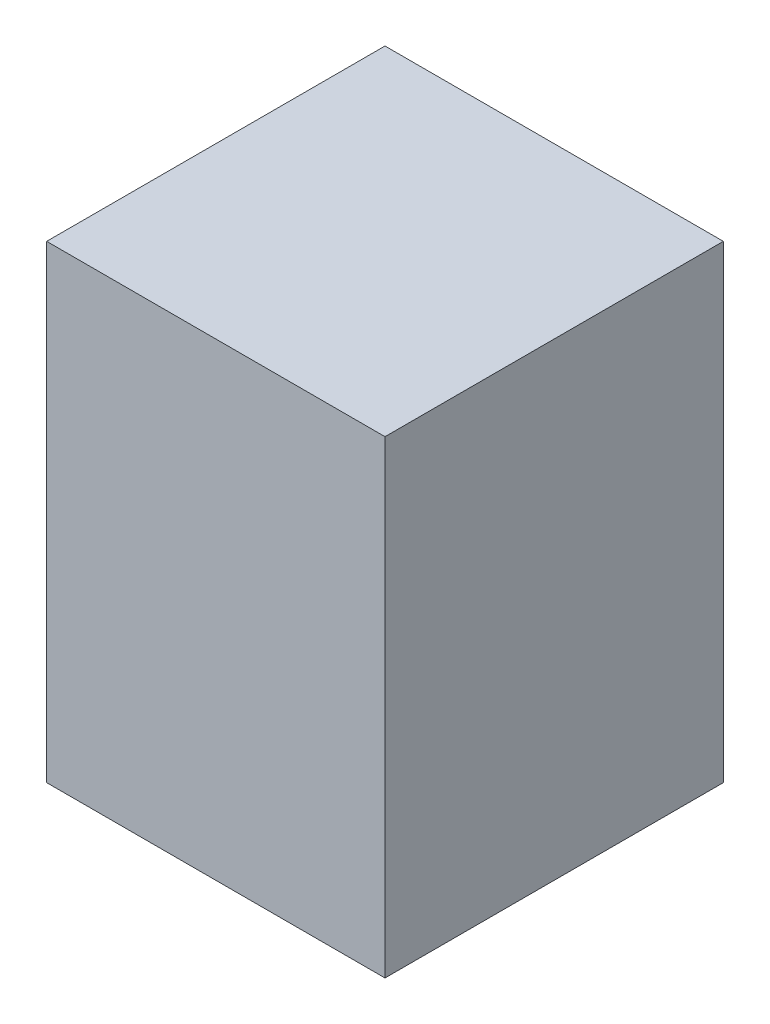
ISO-10303-21;
HEADER;
FILE_DESCRIPTION(('STEP AP214'),'2;1');
FILE_NAME('part.step','',(''),(''),'','','');
FILE_SCHEMA(('AUTOMOTIVE_DESIGN { 1 0 10303 214 1 1 1 1 }'));
ENDSEC;
DATA;
#1=APPLICATION_CONTEXT('core data for automotive mechanical design processes');
#2=APPLICATION_PROTOCOL_DEFINITION('international standard','automotive_design',2000,#1);
#3=PRODUCT_CONTEXT('',#1,'mechanical');
#4=PRODUCT('Part','Part','',(#3));
#5=PRODUCT_RELATED_PRODUCT_CATEGORY('part','',(#4));
#6=PRODUCT_DEFINITION_FORMATION('','',#4);
#7=PRODUCT_DEFINITION_CONTEXT('part definition',#1,'design');
#8=PRODUCT_DEFINITION('design','',#6,#7);
#9=PRODUCT_DEFINITION_SHAPE('','',#8);
#10=(LENGTH_UNIT() NAMED_UNIT(*) SI_UNIT(.MILLI.,.METRE.));
#11=(NAMED_UNIT(*) PLANE_ANGLE_UNIT() SI_UNIT($,.RADIAN.));
#12=(NAMED_UNIT(*) SI_UNIT($,.STERADIAN.) SOLID_ANGLE_UNIT());
#13=UNCERTAINTY_MEASURE_WITH_UNIT(LENGTH_MEASURE(1.E-05),#10,'distance_accuracy_value','');
#14=(GEOMETRIC_REPRESENTATION_CONTEXT(3) GLOBAL_UNCERTAINTY_ASSIGNED_CONTEXT((#13)) GLOBAL_UNIT_ASSIGNED_CONTEXT((#10,
#11,#12)) REPRESENTATION_CONTEXT('',''));
#15=CARTESIAN_POINT('',(0.,0.,0.));
#16=DIRECTION('',(0.,0.,1.));
#17=DIRECTION('',(1.,0.,0.));
#18=AXIS2_PLACEMENT_3D('',#15,#16,#17);
#19=CARTESIAN_POINT('',(-9.75,13.51,0.));
#20=DIRECTION('',(1.,0.,0.));
#21=DIRECTION('',(0.,0.,-1.));
#22=AXIS2_PLACEMENT_3D('',#19,#20,#21);
#23=PLANE('',#22);
#24=DIRECTION('',(0.,0.,1.));
#25=VECTOR('',#24,1.);
#26=CARTESIAN_POINT('',(-9.75,0.,0.));
#27=LINE('',#26,#25);
#28=CARTESIAN_POINT('',(-9.75,0.,0.));
#29=VERTEX_POINT('',#28);
#30=CARTESIAN_POINT('',(-9.75,0.,9.75));
#31=VERTEX_POINT('',#30);
#32=EDGE_CURVE('E102',#29,#31,#27,.T.);
#33=ORIENTED_EDGE('',*,*,#32,.T.);
#34=DIRECTION('',(0.,-1.,0.));
#35=VECTOR('',#34,1.);
#36=CARTESIAN_POINT('',(-9.75,13.51,9.75));
#37=LINE('',#36,#35);
#38=CARTESIAN_POINT('',(-9.75,13.51,9.75));
#39=VERTEX_POINT('',#38);
#40=EDGE_CURVE('E11',#39,#31,#37,.T.);
#41=ORIENTED_EDGE('',*,*,#40,.F.);
#42=DIRECTION('',(0.,0.,1.));
#43=VECTOR('',#42,1.);
#44=CARTESIAN_POINT('',(-9.75,13.51,0.));
#45=LINE('',#44,#43);
#46=CARTESIAN_POINT('',(-9.75,13.51,0.));
#47=VERTEX_POINT('',#46);
#48=EDGE_CURVE('E90',#47,#39,#45,.T.);
#49=ORIENTED_EDGE('',*,*,#48,.F.);
#50=DIRECTION('',(0.,-1.,0.));
#51=VECTOR('',#50,1.);
#52=CARTESIAN_POINT('',(-9.75,13.51,0.));
#53=LINE('',#52,#51);
#54=EDGE_CURVE('E98',#47,#29,#53,.T.);
#55=ORIENTED_EDGE('',*,*,#54,.T.);
#56=EDGE_LOOP('',(#33,#41,#49,#55));
#57=FACE_BOUND('',#56,.T.);
#58=ADVANCED_FACE('F39',(#57),#23,.F.);
#59=CARTESIAN_POINT('',(-9.75,13.51,9.75));
#60=DIRECTION('',(0.,0.,-1.));
#61=DIRECTION('',(-1.,0.,0.));
#62=AXIS2_PLACEMENT_3D('',#59,#60,#61);
#63=PLANE('',#62);
#64=DIRECTION('',(1.,0.,0.));
#65=VECTOR('',#64,1.);
#66=CARTESIAN_POINT('',(-9.75,0.,9.75));
#67=LINE('',#66,#65);
#68=CARTESIAN_POINT('',(0.,0.,9.75));
#69=VERTEX_POINT('',#68);
#70=EDGE_CURVE('E94',#31,#69,#67,.T.);
#71=ORIENTED_EDGE('',*,*,#70,.T.);
#72=DIRECTION('',(0.,-1.,0.));
#73=VECTOR('',#72,1.);
#74=CARTESIAN_POINT('',(0.,13.51,9.75));
#75=LINE('',#74,#73);
#76=CARTESIAN_POINT('',(0.,13.51,9.75));
#77=VERTEX_POINT('',#76);
#78=EDGE_CURVE('E47',#77,#69,#75,.T.);
#79=ORIENTED_EDGE('',*,*,#78,.F.);
#80=DIRECTION('',(1.,0.,0.));
#81=VECTOR('',#80,1.);
#82=CARTESIAN_POINT('',(-9.75,13.51,9.75));
#83=LINE('',#82,#81);
#84=EDGE_CURVE('E85',#39,#77,#83,.T.);
#85=ORIENTED_EDGE('',*,*,#84,.F.);
#86=ORIENTED_EDGE('',*,*,#40,.T.);
#87=EDGE_LOOP('',(#71,#79,#85,#86));
#88=FACE_BOUND('',#87,.T.);
#89=ADVANCED_FACE('F93',(#88),#63,.F.);
#90=CARTESIAN_POINT('',(0.,13.51,0.));
#91=DIRECTION('',(-1.,0.,0.));
#92=DIRECTION('',(0.,0.,1.));
#93=AXIS2_PLACEMENT_3D('',#90,#91,#92);
#94=PLANE('',#93);
#95=DIRECTION('',(0.,0.,-1.));
#96=VECTOR('',#95,1.);
#97=CARTESIAN_POINT('',(0.,0.,0.));
#98=LINE('',#97,#96);
#99=CARTESIAN_POINT('',(0.,0.,0.));
#100=VERTEX_POINT('',#99);
#101=EDGE_CURVE('E72',#69,#100,#98,.T.);
#102=ORIENTED_EDGE('',*,*,#101,.T.);
#103=DIRECTION('',(0.,-1.,0.));
#104=VECTOR('',#103,1.);
#105=CARTESIAN_POINT('',(0.,13.51,0.));
#106=LINE('',#105,#104);
#107=CARTESIAN_POINT('',(0.,13.51,0.));
#108=VERTEX_POINT('',#107);
#109=EDGE_CURVE('E95',#108,#100,#106,.T.);
#110=ORIENTED_EDGE('',*,*,#109,.F.);
#111=DIRECTION('',(0.,0.,-1.));
#112=VECTOR('',#111,1.);
#113=CARTESIAN_POINT('',(0.,13.51,0.));
#114=LINE('',#113,#112);
#115=EDGE_CURVE('E88',#77,#108,#114,.T.);
#116=ORIENTED_EDGE('',*,*,#115,.F.);
#117=ORIENTED_EDGE('',*,*,#78,.T.);
#118=EDGE_LOOP('',(#102,#110,#116,#117));
#119=FACE_BOUND('',#118,.T.);
#120=ADVANCED_FACE('F96',(#119),#94,.F.);
#121=CARTESIAN_POINT('',(-9.75,13.51,0.));
#122=DIRECTION('',(0.,0.,1.));
#123=DIRECTION('',(1.,0.,0.));
#124=AXIS2_PLACEMENT_3D('',#121,#122,#123);
#125=PLANE('',#124);
#126=DIRECTION('',(-1.,0.,0.));
#127=VECTOR('',#126,1.);
#128=CARTESIAN_POINT('',(-9.75,0.,0.));
#129=LINE('',#128,#127);
#130=EDGE_CURVE('E78',#100,#29,#129,.T.);
#131=ORIENTED_EDGE('',*,*,#130,.T.);
#132=ORIENTED_EDGE('',*,*,#54,.F.);
#133=DIRECTION('',(-1.,0.,0.));
#134=VECTOR('',#133,1.);
#135=CARTESIAN_POINT('',(-9.75,13.51,0.));
#136=LINE('',#135,#134);
#137=EDGE_CURVE('E55',#108,#47,#136,.T.);
#138=ORIENTED_EDGE('',*,*,#137,.F.);
#139=ORIENTED_EDGE('',*,*,#109,.T.);
#140=EDGE_LOOP('',(#131,#132,#138,#139));
#141=FACE_BOUND('',#140,.T.);
#142=ADVANCED_FACE('F109',(#141),#125,.F.);
#143=CARTESIAN_POINT('',(0.,13.51,0.));
#144=DIRECTION('',(0.,1.,0.));
#145=DIRECTION('',(0.,0.,1.));
#146=AXIS2_PLACEMENT_3D('',#143,#144,#145);
#147=PLANE('',#146);
#148=ORIENTED_EDGE('',*,*,#48,.T.);
#149=ORIENTED_EDGE('',*,*,#84,.T.);
#150=ORIENTED_EDGE('',*,*,#115,.T.);
#151=ORIENTED_EDGE('',*,*,#137,.T.);
#152=EDGE_LOOP('',(#148,#149,#150,#151));
#153=FACE_BOUND('',#152,.T.);
#154=ADVANCED_FACE('F86',(#153),#147,.T.);
#155=CARTESIAN_POINT('',(0.,0.,0.));
#156=DIRECTION('',(0.,1.,0.));
#157=DIRECTION('',(0.,0.,1.));
#158=AXIS2_PLACEMENT_3D('',#155,#156,#157);
#159=PLANE('',#158);
#160=ORIENTED_EDGE('',*,*,#32,.F.);
#161=ORIENTED_EDGE('',*,*,#130,.F.);
#162=ORIENTED_EDGE('',*,*,#101,.F.);
#163=ORIENTED_EDGE('',*,*,#70,.F.);
#164=EDGE_LOOP('',(#160,#161,#162,#163));
#165=FACE_BOUND('',#164,.T.);
#166=ADVANCED_FACE('F112',(#165),#159,.F.);
#167=CLOSED_SHELL('',(#58,#89,#120,#142,#154,#166));
#168=MANIFOLD_SOLID_BREP('B2',#167);
#169=ADVANCED_BREP_SHAPE_REPRESENTATION('',(#18,#168),#14);
#170=SHAPE_DEFINITION_REPRESENTATION(#9,#169);
ENDSEC;
END-ISO-10303-21;
